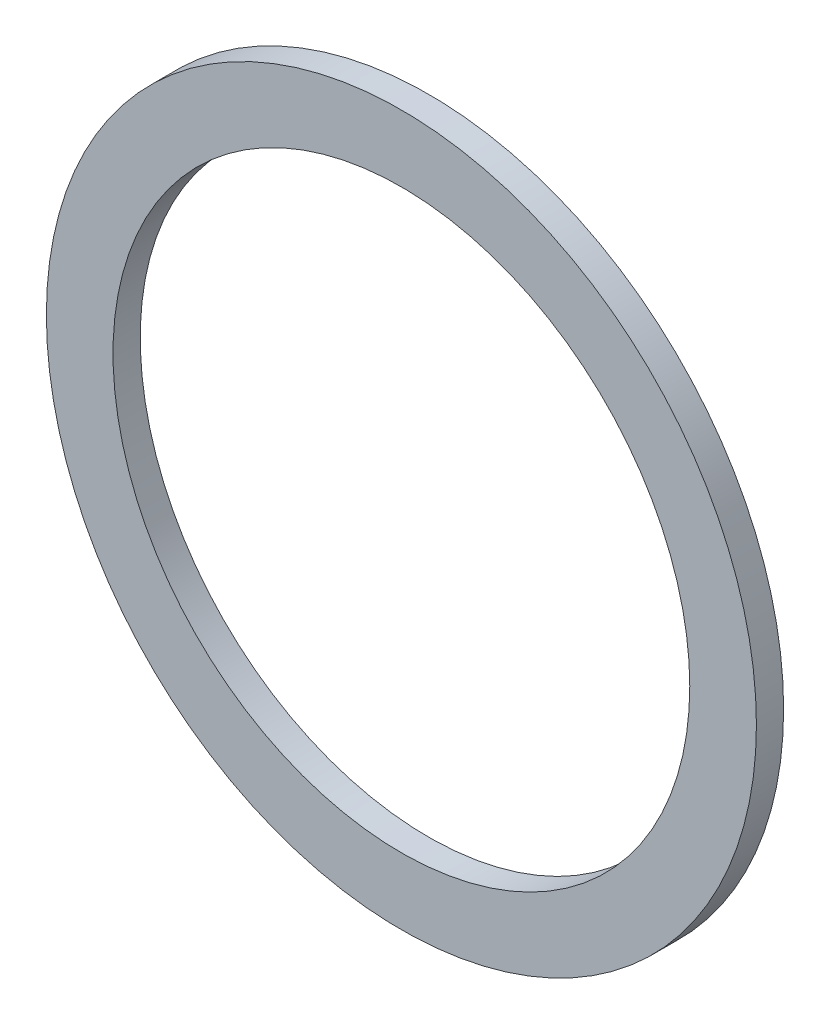
ISO-10303-21;
HEADER;
FILE_DESCRIPTION(('STEP AP214'),'2;1');
FILE_NAME('part.step','',(''),(''),'','','');
FILE_SCHEMA(('AUTOMOTIVE_DESIGN { 1 0 10303 214 1 1 1 1 }'));
ENDSEC;
DATA;
#1=APPLICATION_CONTEXT('core data for automotive mechanical design processes');
#2=APPLICATION_PROTOCOL_DEFINITION('international standard','automotive_design',2000,#1);
#3=PRODUCT_CONTEXT('',#1,'mechanical');
#4=PRODUCT('Part','Part','',(#3));
#5=PRODUCT_RELATED_PRODUCT_CATEGORY('part','',(#4));
#6=PRODUCT_DEFINITION_FORMATION('','',#4);
#7=PRODUCT_DEFINITION_CONTEXT('part definition',#1,'design');
#8=PRODUCT_DEFINITION('design','',#6,#7);
#9=PRODUCT_DEFINITION_SHAPE('','',#8);
#10=(LENGTH_UNIT() NAMED_UNIT(*) SI_UNIT(.MILLI.,.METRE.));
#11=(NAMED_UNIT(*) PLANE_ANGLE_UNIT() SI_UNIT($,.RADIAN.));
#12=(NAMED_UNIT(*) SI_UNIT($,.STERADIAN.) SOLID_ANGLE_UNIT());
#13=UNCERTAINTY_MEASURE_WITH_UNIT(LENGTH_MEASURE(1.E-05),#10,'distance_accuracy_value','');
#14=(GEOMETRIC_REPRESENTATION_CONTEXT(3) GLOBAL_UNCERTAINTY_ASSIGNED_CONTEXT((#13)) GLOBAL_UNIT_ASSIGNED_CONTEXT((#10,
#11,#12)) REPRESENTATION_CONTEXT('',''));
#15=CARTESIAN_POINT('',(0.,0.,0.));
#16=DIRECTION('',(0.,0.,1.));
#17=DIRECTION('',(1.,0.,0.));
#18=AXIS2_PLACEMENT_3D('',#15,#16,#17);
#19=CARTESIAN_POINT('',(0.,0.,1.));
#20=DIRECTION('',(0.,0.,1.));
#21=DIRECTION('',(1.,0.,0.));
#22=AXIS2_PLACEMENT_3D('',#19,#20,#21);
#23=PLANE('',#22);
#24=CARTESIAN_POINT('',(0.,0.,1.));
#25=DIRECTION('',(0.,0.,1.));
#26=DIRECTION('',(1.,0.,0.));
#27=AXIS2_PLACEMENT_3D('',#24,#25,#26);
#28=CIRCLE('',#27,13.05);
#29=CARTESIAN_POINT('',(13.05,0.,1.));
#30=VERTEX_POINT('',#29);
#31=EDGE_CURVE('E10',#30,#30,#28,.T.);
#32=ORIENTED_EDGE('',*,*,#31,.T.);
#33=EDGE_LOOP('',(#32));
#34=FACE_BOUND('',#33,.T.);
#35=CARTESIAN_POINT('',(0.,0.,1.));
#36=DIRECTION('',(0.,0.,1.));
#37=DIRECTION('',(1.,0.,0.));
#38=AXIS2_PLACEMENT_3D('',#35,#36,#37);
#39=CIRCLE('',#38,10.6);
#40=CARTESIAN_POINT('',(10.6,0.,1.));
#41=VERTEX_POINT('',#40);
#42=EDGE_CURVE('E42',#41,#41,#39,.T.);
#43=ORIENTED_EDGE('',*,*,#42,.F.);
#44=EDGE_LOOP('',(#43));
#45=FACE_BOUND('',#44,.T.);
#46=ADVANCED_FACE('F31',(#34,#45),#23,.T.);
#47=CARTESIAN_POINT('',(0.,0.,0.));
#48=DIRECTION('',(0.,0.,1.));
#49=DIRECTION('',(1.,0.,0.));
#50=AXIS2_PLACEMENT_3D('',#47,#48,#49);
#51=PLANE('',#50);
#52=CARTESIAN_POINT('',(0.,0.,0.));
#53=DIRECTION('',(0.,0.,1.));
#54=DIRECTION('',(1.,0.,0.));
#55=AXIS2_PLACEMENT_3D('',#52,#53,#54);
#56=CIRCLE('',#55,13.05);
#57=CARTESIAN_POINT('',(13.05,0.,0.));
#58=VERTEX_POINT('',#57);
#59=EDGE_CURVE('E35',#58,#58,#56,.T.);
#60=ORIENTED_EDGE('',*,*,#59,.F.);
#61=EDGE_LOOP('',(#60));
#62=FACE_BOUND('',#61,.T.);
#63=CARTESIAN_POINT('',(0.,0.,0.));
#64=DIRECTION('',(0.,0.,1.));
#65=DIRECTION('',(1.,0.,0.));
#66=AXIS2_PLACEMENT_3D('',#63,#64,#65);
#67=CIRCLE('',#66,10.6);
#68=CARTESIAN_POINT('',(10.6,0.,0.));
#69=VERTEX_POINT('',#68);
#70=EDGE_CURVE('E44',#69,#69,#67,.T.);
#71=ORIENTED_EDGE('',*,*,#70,.T.);
#72=EDGE_LOOP('',(#71));
#73=FACE_BOUND('',#72,.T.);
#74=ADVANCED_FACE('F54',(#62,#73),#51,.F.);
#75=CARTESIAN_POINT('',(0.,0.,1.));
#76=DIRECTION('',(0.,0.,-1.));
#77=DIRECTION('',(-1.,0.,0.));
#78=AXIS2_PLACEMENT_3D('',#75,#76,#77);
#79=CYLINDRICAL_SURFACE('',#78,13.05);
#80=ORIENTED_EDGE('',*,*,#31,.F.);
#81=EDGE_LOOP('',(#80));
#82=FACE_BOUND('',#81,.T.);
#83=ORIENTED_EDGE('',*,*,#59,.T.);
#84=EDGE_LOOP('',(#83));
#85=FACE_BOUND('',#84,.T.);
#86=ADVANCED_FACE('F33',(#82,#85),#79,.T.);
#87=CARTESIAN_POINT('',(0.,0.,1.));
#88=DIRECTION('',(0.,0.,-1.));
#89=DIRECTION('',(-1.,0.,0.));
#90=AXIS2_PLACEMENT_3D('',#87,#88,#89);
#91=CYLINDRICAL_SURFACE('',#90,10.6);
#92=ORIENTED_EDGE('',*,*,#42,.T.);
#93=EDGE_LOOP('',(#92));
#94=FACE_BOUND('',#93,.T.);
#95=ORIENTED_EDGE('',*,*,#70,.F.);
#96=EDGE_LOOP('',(#95));
#97=FACE_BOUND('',#96,.T.);
#98=ADVANCED_FACE('F50',(#94,#97),#91,.F.);
#99=CLOSED_SHELL('',(#46,#74,#86,#98));
#100=MANIFOLD_SOLID_BREP('B2',#99);
#101=ADVANCED_BREP_SHAPE_REPRESENTATION('',(#18,#100),#14);
#102=SHAPE_DEFINITION_REPRESENTATION(#9,#101);
ENDSEC;
END-ISO-10303-21;
